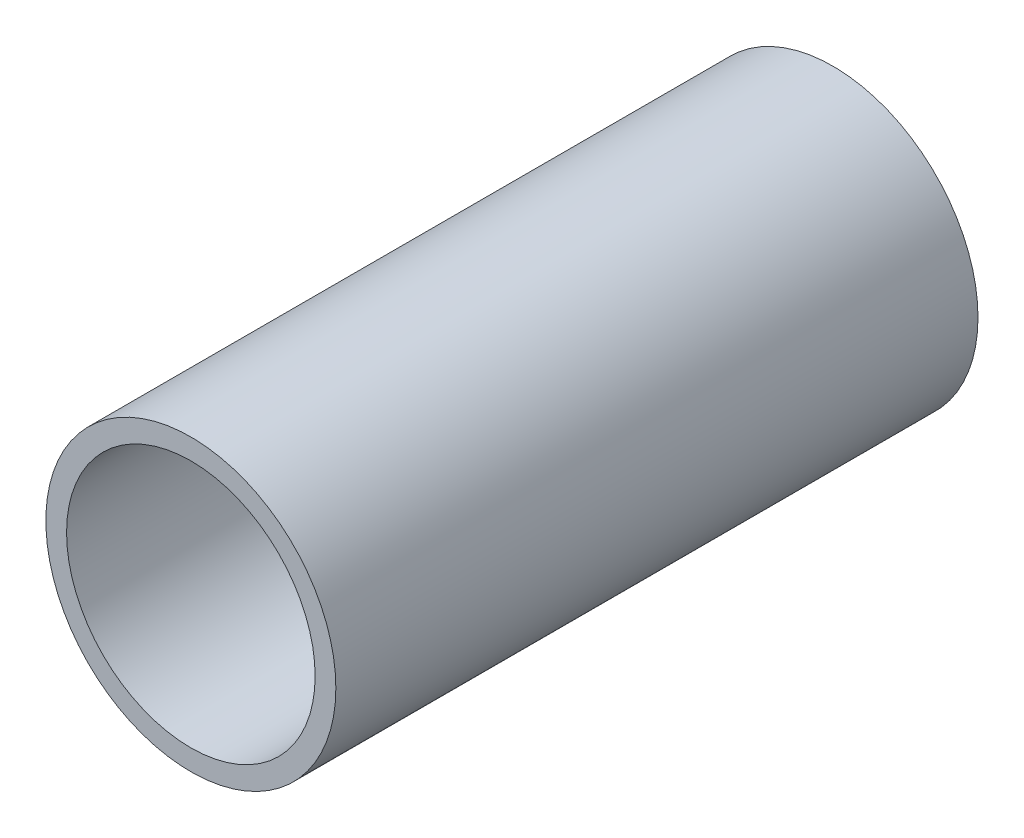
ISO-10303-21;
HEADER;
FILE_DESCRIPTION(('STEP AP214'),'2;1');
FILE_NAME('part.step','',(''),(''),'','','');
FILE_SCHEMA(('AUTOMOTIVE_DESIGN { 1 0 10303 214 1 1 1 1 }'));
ENDSEC;
DATA;
#1=APPLICATION_CONTEXT('core data for automotive mechanical design processes');
#2=APPLICATION_PROTOCOL_DEFINITION('international standard','automotive_design',2000,#1);
#3=PRODUCT_CONTEXT('',#1,'mechanical');
#4=PRODUCT('Part','Part','',(#3));
#5=PRODUCT_RELATED_PRODUCT_CATEGORY('part','',(#4));
#6=PRODUCT_DEFINITION_FORMATION('','',#4);
#7=PRODUCT_DEFINITION_CONTEXT('part definition',#1,'design');
#8=PRODUCT_DEFINITION('design','',#6,#7);
#9=PRODUCT_DEFINITION_SHAPE('','',#8);
#10=(LENGTH_UNIT() NAMED_UNIT(*) SI_UNIT(.MILLI.,.METRE.));
#11=(NAMED_UNIT(*) PLANE_ANGLE_UNIT() SI_UNIT($,.RADIAN.));
#12=(NAMED_UNIT(*) SI_UNIT($,.STERADIAN.) SOLID_ANGLE_UNIT());
#13=UNCERTAINTY_MEASURE_WITH_UNIT(LENGTH_MEASURE(1.E-05),#10,'distance_accuracy_value','');
#14=(GEOMETRIC_REPRESENTATION_CONTEXT(3) GLOBAL_UNCERTAINTY_ASSIGNED_CONTEXT((#13)) GLOBAL_UNIT_ASSIGNED_CONTEXT((#10,
#11,#12)) REPRESENTATION_CONTEXT('',''));
#15=CARTESIAN_POINT('',(0.,0.,0.));
#16=DIRECTION('',(0.,0.,1.));
#17=DIRECTION('',(1.,0.,0.));
#18=AXIS2_PLACEMENT_3D('',#15,#16,#17);
#19=CARTESIAN_POINT('',(0.,0.,98.425));
#20=DIRECTION('',(0.,0.,1.));
#21=DIRECTION('',(1.,0.,0.));
#22=AXIS2_PLACEMENT_3D('',#19,#20,#21);
#23=PLANE('',#22);
#24=CARTESIAN_POINT('',(0.,0.,98.425));
#25=DIRECTION('',(0.,0.,1.));
#26=DIRECTION('',(1.,0.,0.));
#27=AXIS2_PLACEMENT_3D('',#24,#25,#26);
#28=CIRCLE('',#27,44.45);
#29=CARTESIAN_POINT('',(44.45,0.,98.425));
#30=VERTEX_POINT('',#29);
#31=EDGE_CURVE('E10',#30,#30,#28,.T.);
#32=ORIENTED_EDGE('',*,*,#31,.T.);
#33=EDGE_LOOP('',(#32));
#34=FACE_BOUND('',#33,.T.);
#35=CARTESIAN_POINT('',(0.,0.,98.425));
#36=DIRECTION('',(0.,0.,1.));
#37=DIRECTION('',(1.,0.,0.));
#38=AXIS2_PLACEMENT_3D('',#35,#36,#37);
#39=CIRCLE('',#38,38.1);
#40=CARTESIAN_POINT('',(38.1,0.,98.425));
#41=VERTEX_POINT('',#40);
#42=EDGE_CURVE('E41',#41,#41,#39,.T.);
#43=ORIENTED_EDGE('',*,*,#42,.F.);
#44=EDGE_LOOP('',(#43));
#45=FACE_BOUND('',#44,.T.);
#46=ADVANCED_FACE('F30',(#34,#45),#23,.T.);
#47=CARTESIAN_POINT('',(0.,0.,-98.425));
#48=DIRECTION('',(0.,0.,1.));
#49=DIRECTION('',(1.,0.,0.));
#50=AXIS2_PLACEMENT_3D('',#47,#48,#49);
#51=PLANE('',#50);
#52=CARTESIAN_POINT('',(0.,0.,-98.425));
#53=DIRECTION('',(0.,0.,1.));
#54=DIRECTION('',(1.,0.,0.));
#55=AXIS2_PLACEMENT_3D('',#52,#53,#54);
#56=CIRCLE('',#55,44.45);
#57=CARTESIAN_POINT('',(44.45,0.,-98.425));
#58=VERTEX_POINT('',#57);
#59=EDGE_CURVE('E34',#58,#58,#56,.T.);
#60=ORIENTED_EDGE('',*,*,#59,.F.);
#61=EDGE_LOOP('',(#60));
#62=FACE_BOUND('',#61,.T.);
#63=CARTESIAN_POINT('',(0.,0.,-98.425));
#64=DIRECTION('',(0.,0.,1.));
#65=DIRECTION('',(1.,0.,0.));
#66=AXIS2_PLACEMENT_3D('',#63,#64,#65);
#67=CIRCLE('',#66,38.1);
#68=CARTESIAN_POINT('',(38.1,0.,-98.425));
#69=VERTEX_POINT('',#68);
#70=EDGE_CURVE('E43',#69,#69,#67,.T.);
#71=ORIENTED_EDGE('',*,*,#70,.T.);
#72=EDGE_LOOP('',(#71));
#73=FACE_BOUND('',#72,.T.);
#74=ADVANCED_FACE('F53',(#62,#73),#51,.F.);
#75=CARTESIAN_POINT('',(0.,0.,98.425));
#76=DIRECTION('',(0.,0.,-1.));
#77=DIRECTION('',(-1.,0.,0.));
#78=AXIS2_PLACEMENT_3D('',#75,#76,#77);
#79=CYLINDRICAL_SURFACE('',#78,44.45);
#80=ORIENTED_EDGE('',*,*,#31,.F.);
#81=EDGE_LOOP('',(#80));
#82=FACE_BOUND('',#81,.T.);
#83=ORIENTED_EDGE('',*,*,#59,.T.);
#84=EDGE_LOOP('',(#83));
#85=FACE_BOUND('',#84,.T.);
#86=ADVANCED_FACE('F32',(#82,#85),#79,.T.);
#87=CARTESIAN_POINT('',(0.,0.,98.425));
#88=DIRECTION('',(0.,0.,-1.));
#89=DIRECTION('',(-1.,0.,0.));
#90=AXIS2_PLACEMENT_3D('',#87,#88,#89);
#91=CYLINDRICAL_SURFACE('',#90,38.1);
#92=ORIENTED_EDGE('',*,*,#42,.T.);
#93=EDGE_LOOP('',(#92));
#94=FACE_BOUND('',#93,.T.);
#95=ORIENTED_EDGE('',*,*,#70,.F.);
#96=EDGE_LOOP('',(#95));
#97=FACE_BOUND('',#96,.T.);
#98=ADVANCED_FACE('F49',(#94,#97),#91,.F.);
#99=CLOSED_SHELL('',(#46,#74,#86,#98));
#100=MANIFOLD_SOLID_BREP('B2',#99);
#101=ADVANCED_BREP_SHAPE_REPRESENTATION('',(#18,#100),#14);
#102=SHAPE_DEFINITION_REPRESENTATION(#9,#101);
ENDSEC;
END-ISO-10303-21;
